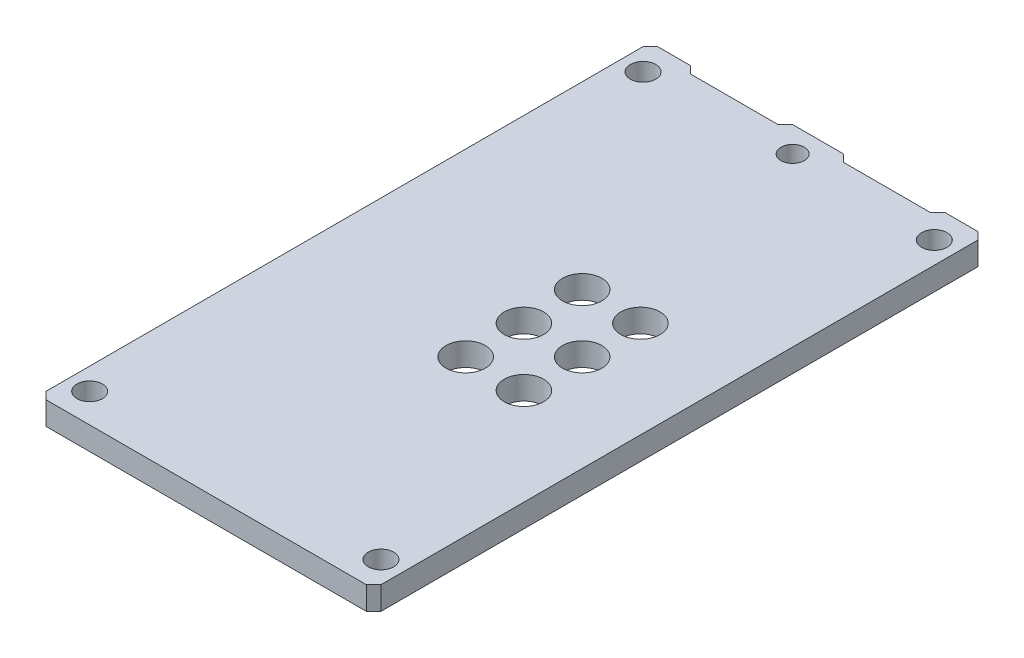
ISO-10303-21;
HEADER;
FILE_DESCRIPTION(('STEP AP214'),'2;1');
FILE_NAME('part.step','',(''),(''),'','','');
FILE_SCHEMA(('AUTOMOTIVE_DESIGN { 1 0 10303 214 1 1 1 1 }'));
ENDSEC;
DATA;
#1=APPLICATION_CONTEXT('core data for automotive mechanical design processes');
#2=APPLICATION_PROTOCOL_DEFINITION('international standard','automotive_design',2000,#1);
#3=PRODUCT_CONTEXT('',#1,'mechanical');
#4=PRODUCT('Part','Part','',(#3));
#5=PRODUCT_RELATED_PRODUCT_CATEGORY('part','',(#4));
#6=PRODUCT_DEFINITION_FORMATION('','',#4);
#7=PRODUCT_DEFINITION_CONTEXT('part definition',#1,'design');
#8=PRODUCT_DEFINITION('design','',#6,#7);
#9=PRODUCT_DEFINITION_SHAPE('','',#8);
#10=(LENGTH_UNIT() NAMED_UNIT(*) SI_UNIT(.MILLI.,.METRE.));
#11=(NAMED_UNIT(*) PLANE_ANGLE_UNIT() SI_UNIT($,.RADIAN.));
#12=(NAMED_UNIT(*) SI_UNIT($,.STERADIAN.) SOLID_ANGLE_UNIT());
#13=UNCERTAINTY_MEASURE_WITH_UNIT(LENGTH_MEASURE(1.E-05),#10,'distance_accuracy_value','');
#14=(GEOMETRIC_REPRESENTATION_CONTEXT(3) GLOBAL_UNCERTAINTY_ASSIGNED_CONTEXT((#13)) GLOBAL_UNIT_ASSIGNED_CONTEXT((#10,
#11,#12)) REPRESENTATION_CONTEXT('',''));
#15=CARTESIAN_POINT('',(0.,0.,0.));
#16=DIRECTION('',(0.,0.,1.));
#17=DIRECTION('',(1.,0.,0.));
#18=AXIS2_PLACEMENT_3D('',#15,#16,#17);
#19=CARTESIAN_POINT('',(23.,1.5875,0.));
#20=DIRECTION('',(0.,1.,0.));
#21=DIRECTION('',(0.,0.,1.));
#22=AXIS2_PLACEMENT_3D('',#19,#20,#21);
#23=PLANE('',#22);
#24=CARTESIAN_POINT('',(1.5,1.5875,-40.));
#25=DIRECTION('',(0.,1.,0.));
#26=DIRECTION('',(0.,0.,1.));
#27=AXIS2_PLACEMENT_3D('',#24,#25,#26);
#28=CIRCLE('',#27,0.875000000000001);
#29=CARTESIAN_POINT('',(1.5,1.5875,-39.125));
#30=VERTEX_POINT('',#29);
#31=EDGE_CURVE('E370',#30,#30,#28,.T.);
#32=ORIENTED_EDGE('',*,*,#31,.F.);
#33=EDGE_LOOP('',(#32));
#34=FACE_BOUND('',#33,.T.);
#35=CARTESIAN_POINT('',(21.5,1.5875,-2.));
#36=DIRECTION('',(0.,1.,0.));
#37=DIRECTION('',(0.,0.,1.));
#38=AXIS2_PLACEMENT_3D('',#35,#36,#37);
#39=CIRCLE('',#38,0.875000000000002);
#40=CARTESIAN_POINT('',(21.5,1.5875,-1.125));
#41=VERTEX_POINT('',#40);
#42=EDGE_CURVE('E382',#41,#41,#39,.T.);
#43=ORIENTED_EDGE('',*,*,#42,.F.);
#44=EDGE_LOOP('',(#43));
#45=FACE_BOUND('',#44,.T.);
#46=CARTESIAN_POINT('',(16.36,1.5875,-24.96));
#47=DIRECTION('',(0.,1.,0.));
#48=DIRECTION('',(0.,0.,1.));
#49=AXIS2_PLACEMENT_3D('',#46,#47,#48);
#50=CIRCLE('',#49,1.35);
#51=CARTESIAN_POINT('',(16.36,1.5875,-23.61));
#52=VERTEX_POINT('',#51);
#53=EDGE_CURVE('E394',#52,#52,#50,.T.);
#54=ORIENTED_EDGE('',*,*,#53,.F.);
#55=EDGE_LOOP('',(#54));
#56=FACE_BOUND('',#55,.T.);
#57=CARTESIAN_POINT('',(16.36,1.5875,-20.96));
#58=DIRECTION('',(0.,1.,0.));
#59=DIRECTION('',(0.,0.,1.));
#60=AXIS2_PLACEMENT_3D('',#57,#58,#59);
#61=CIRCLE('',#60,1.35);
#62=CARTESIAN_POINT('',(16.36,1.5875,-19.61));
#63=VERTEX_POINT('',#62);
#64=EDGE_CURVE('E406',#63,#63,#61,.T.);
#65=ORIENTED_EDGE('',*,*,#64,.F.);
#66=EDGE_LOOP('',(#65));
#67=FACE_BOUND('',#66,.T.);
#68=CARTESIAN_POINT('',(16.36,1.5875,-16.96));
#69=DIRECTION('',(0.,1.,0.));
#70=DIRECTION('',(0.,0.,1.));
#71=AXIS2_PLACEMENT_3D('',#68,#69,#70);
#72=CIRCLE('',#71,1.35);
#73=CARTESIAN_POINT('',(16.36,1.5875,-15.61));
#74=VERTEX_POINT('',#73);
#75=EDGE_CURVE('E418',#74,#74,#72,.T.);
#76=ORIENTED_EDGE('',*,*,#75,.F.);
#77=EDGE_LOOP('',(#76));
#78=FACE_BOUND('',#77,.T.);
#79=DIRECTION('',(1.,0.,0.));
#80=VECTOR('',#79,1.);
#81=CARTESIAN_POINT('',(0.500000000000004,1.5875,0.));
#82=LINE('',#81,#80);
#83=CARTESIAN_POINT('',(0.500000000000004,1.5875,0.));
#84=VERTEX_POINT('',#83);
#85=CARTESIAN_POINT('',(22.5,1.5875,0.));
#86=VERTEX_POINT('',#85);
#87=EDGE_CURVE('E207',#84,#86,#82,.T.);
#88=ORIENTED_EDGE('',*,*,#87,.T.);
#89=DIRECTION('',(0.707106781186547,0.,-0.707106781186547));
#90=VECTOR('',#89,1.);
#91=CARTESIAN_POINT('',(22.5,1.5875,0.));
#92=LINE('',#91,#90);
#93=CARTESIAN_POINT('',(23.,1.5875,-0.5));
#94=VERTEX_POINT('',#93);
#95=EDGE_CURVE('E115',#86,#94,#92,.T.);
#96=ORIENTED_EDGE('',*,*,#95,.T.);
#97=DIRECTION('',(0.,0.,-1.));
#98=VECTOR('',#97,1.);
#99=CARTESIAN_POINT('',(23.,1.5875,-0.5));
#100=LINE('',#99,#98);
#101=CARTESIAN_POINT('',(23.,1.5875,-41.5));
#102=VERTEX_POINT('',#101);
#103=EDGE_CURVE('E246',#94,#102,#100,.T.);
#104=ORIENTED_EDGE('',*,*,#103,.T.);
#105=DIRECTION('',(-0.707106781186547,0.,-0.707106781186547));
#106=VECTOR('',#105,1.);
#107=CARTESIAN_POINT('',(23.,1.5875,-41.5));
#108=LINE('',#107,#106);
#109=CARTESIAN_POINT('',(22.5,1.5875,-42.));
#110=VERTEX_POINT('',#109);
#111=EDGE_CURVE('E265',#102,#110,#108,.T.);
#112=ORIENTED_EDGE('',*,*,#111,.T.);
#113=DIRECTION('',(-1.,0.,0.));
#114=VECTOR('',#113,1.);
#115=CARTESIAN_POINT('',(20.25,1.5875,-42.));
#116=LINE('',#115,#114);
#117=CARTESIAN_POINT('',(20.25,1.5875,-42.));
#118=VERTEX_POINT('',#117);
#119=EDGE_CURVE('E262',#110,#118,#116,.T.);
#120=ORIENTED_EDGE('',*,*,#119,.T.);
#121=DIRECTION('',(-0.707106781186545,0.,0.70710678118655));
#122=VECTOR('',#121,1.);
#123=CARTESIAN_POINT('',(19.75,1.5875,-41.5));
#124=LINE('',#123,#122);
#125=CARTESIAN_POINT('',(19.75,1.5875,-41.5));
#126=VERTEX_POINT('',#125);
#127=EDGE_CURVE('E264',#118,#126,#124,.T.);
#128=ORIENTED_EDGE('',*,*,#127,.T.);
#129=DIRECTION('',(-1.,0.,0.));
#130=VECTOR('',#129,1.);
#131=CARTESIAN_POINT('',(13.75,1.5875,-41.5));
#132=LINE('',#131,#130);
#133=CARTESIAN_POINT('',(13.75,1.5875,-41.5));
#134=VERTEX_POINT('',#133);
#135=EDGE_CURVE('E267',#126,#134,#132,.T.);
#136=ORIENTED_EDGE('',*,*,#135,.T.);
#137=DIRECTION('',(-0.707106781186547,0.,-0.707106781186547));
#138=VECTOR('',#137,1.);
#139=CARTESIAN_POINT('',(13.25,1.5875,-42.));
#140=LINE('',#139,#138);
#141=CARTESIAN_POINT('',(13.25,1.5875,-42.));
#142=VERTEX_POINT('',#141);
#143=EDGE_CURVE('E273',#134,#142,#140,.T.);
#144=ORIENTED_EDGE('',*,*,#143,.T.);
#145=DIRECTION('',(-1.,0.,0.));
#146=VECTOR('',#145,1.);
#147=CARTESIAN_POINT('',(9.75,1.5875,-42.));
#148=LINE('',#147,#146);
#149=CARTESIAN_POINT('',(9.75,1.5875,-42.));
#150=VERTEX_POINT('',#149);
#151=EDGE_CURVE('E275',#142,#150,#148,.T.);
#152=ORIENTED_EDGE('',*,*,#151,.T.);
#153=DIRECTION('',(-0.707106781186547,0.,0.707106781186547));
#154=VECTOR('',#153,1.);
#155=CARTESIAN_POINT('',(9.75,1.5875,-42.));
#156=LINE('',#155,#154);
#157=CARTESIAN_POINT('',(9.25,1.5875,-41.5));
#158=VERTEX_POINT('',#157);
#159=EDGE_CURVE('E277',#150,#158,#156,.T.);
#160=ORIENTED_EDGE('',*,*,#159,.T.);
#161=DIRECTION('',(-1.,0.,0.));
#162=VECTOR('',#161,1.);
#163=CARTESIAN_POINT('',(9.25,1.5875,-41.5));
#164=LINE('',#163,#162);
#165=CARTESIAN_POINT('',(3.25,1.5875,-41.5));
#166=VERTEX_POINT('',#165);
#167=EDGE_CURVE('E279',#158,#166,#164,.T.);
#168=ORIENTED_EDGE('',*,*,#167,.T.);
#169=DIRECTION('',(-0.707106781186547,0.,-0.707106781186548));
#170=VECTOR('',#169,1.);
#171=CARTESIAN_POINT('',(3.25,1.5875,-41.5));
#172=LINE('',#171,#170);
#173=CARTESIAN_POINT('',(2.75,1.5875,-42.));
#174=VERTEX_POINT('',#173);
#175=EDGE_CURVE('E281',#166,#174,#172,.T.);
#176=ORIENTED_EDGE('',*,*,#175,.T.);
#177=DIRECTION('',(-1.,0.,0.));
#178=VECTOR('',#177,1.);
#179=CARTESIAN_POINT('',(2.75,1.5875,-42.));
#180=LINE('',#179,#178);
#181=CARTESIAN_POINT('',(0.500000000000001,1.5875,-42.));
#182=VERTEX_POINT('',#181);
#183=EDGE_CURVE('E158',#174,#182,#180,.T.);
#184=ORIENTED_EDGE('',*,*,#183,.T.);
#185=DIRECTION('',(-0.707106781186548,0.,0.707106781186547));
#186=VECTOR('',#185,1.);
#187=CARTESIAN_POINT('',(0.500000000000001,1.5875,-42.));
#188=LINE('',#187,#186);
#189=CARTESIAN_POINT('',(0.,1.5875,-41.5));
#190=VERTEX_POINT('',#189);
#191=EDGE_CURVE('E152',#182,#190,#188,.T.);
#192=ORIENTED_EDGE('',*,*,#191,.T.);
#193=DIRECTION('',(0.,0.,1.));
#194=VECTOR('',#193,1.);
#195=CARTESIAN_POINT('',(0.,1.5875,-41.5));
#196=LINE('',#195,#194);
#197=CARTESIAN_POINT('',(0.,1.5875,-0.5));
#198=VERTEX_POINT('',#197);
#199=EDGE_CURVE('E156',#190,#198,#196,.T.);
#200=ORIENTED_EDGE('',*,*,#199,.T.);
#201=DIRECTION('',(0.707106781186547,0.,0.707106781186548));
#202=VECTOR('',#201,1.);
#203=CARTESIAN_POINT('',(0.,1.5875,-0.5));
#204=LINE('',#203,#202);
#205=EDGE_CURVE('E48',#198,#84,#204,.T.);
#206=ORIENTED_EDGE('',*,*,#205,.T.);
#207=EDGE_LOOP('',(#88,#96,#104,#112,#120,#128,#136,#144,#152,#160,#168,#176,#184,#192,#200,#206));
#208=FACE_BOUND('',#207,.T.);
#209=CARTESIAN_POINT('',(12.36,1.5875,-16.96));
#210=DIRECTION('',(0.,1.,0.));
#211=DIRECTION('',(0.,0.,1.));
#212=AXIS2_PLACEMENT_3D('',#209,#210,#211);
#213=CIRCLE('',#212,1.35);
#214=CARTESIAN_POINT('',(12.36,1.5875,-15.61));
#215=VERTEX_POINT('',#214);
#216=EDGE_CURVE('E180',#215,#215,#213,.T.);
#217=ORIENTED_EDGE('',*,*,#216,.F.);
#218=EDGE_LOOP('',(#217));
#219=FACE_BOUND('',#218,.T.);
#220=CARTESIAN_POINT('',(12.36,1.5875,-20.96));
#221=DIRECTION('',(0.,1.,0.));
#222=DIRECTION('',(0.,0.,1.));
#223=AXIS2_PLACEMENT_3D('',#220,#221,#222);
#224=CIRCLE('',#223,1.35);
#225=CARTESIAN_POINT('',(12.36,1.5875,-19.61));
#226=VERTEX_POINT('',#225);
#227=EDGE_CURVE('E412',#226,#226,#224,.T.);
#228=ORIENTED_EDGE('',*,*,#227,.F.);
#229=EDGE_LOOP('',(#228));
#230=FACE_BOUND('',#229,.T.);
#231=CARTESIAN_POINT('',(12.36,1.5875,-24.96));
#232=DIRECTION('',(0.,1.,0.));
#233=DIRECTION('',(0.,0.,1.));
#234=AXIS2_PLACEMENT_3D('',#231,#232,#233);
#235=CIRCLE('',#234,1.35);
#236=CARTESIAN_POINT('',(12.36,1.5875,-23.61));
#237=VERTEX_POINT('',#236);
#238=EDGE_CURVE('E400',#237,#237,#235,.T.);
#239=ORIENTED_EDGE('',*,*,#238,.F.);
#240=EDGE_LOOP('',(#239));
#241=FACE_BOUND('',#240,.T.);
#242=CARTESIAN_POINT('',(21.5,1.5875,-40.));
#243=DIRECTION('',(0.,1.,0.));
#244=DIRECTION('',(0.,0.,1.));
#245=AXIS2_PLACEMENT_3D('',#242,#243,#244);
#246=CIRCLE('',#245,0.875000000000002);
#247=CARTESIAN_POINT('',(21.5,1.5875,-39.125));
#248=VERTEX_POINT('',#247);
#249=EDGE_CURVE('E388',#248,#248,#246,.T.);
#250=ORIENTED_EDGE('',*,*,#249,.F.);
#251=EDGE_LOOP('',(#250));
#252=FACE_BOUND('',#251,.T.);
#253=CARTESIAN_POINT('',(1.5,1.5875,-2.));
#254=DIRECTION('',(0.,1.,0.));
#255=DIRECTION('',(0.,0.,1.));
#256=AXIS2_PLACEMENT_3D('',#253,#254,#255);
#257=CIRCLE('',#256,0.875);
#258=CARTESIAN_POINT('',(1.5,1.5875,-1.125));
#259=VERTEX_POINT('',#258);
#260=EDGE_CURVE('E376',#259,#259,#257,.T.);
#261=ORIENTED_EDGE('',*,*,#260,.F.);
#262=EDGE_LOOP('',(#261));
#263=FACE_BOUND('',#262,.T.);
#264=CARTESIAN_POINT('',(11.5154,1.5875,-40.2552));
#265=DIRECTION('',(0.,1.,0.));
#266=DIRECTION('',(0.,0.,1.));
#267=AXIS2_PLACEMENT_3D('',#264,#265,#266);
#268=CIRCLE('',#267,0.8001);
#269=CARTESIAN_POINT('',(11.5154,1.5875,-39.4551));
#270=VERTEX_POINT('',#269);
#271=EDGE_CURVE('E361',#270,#270,#268,.T.);
#272=ORIENTED_EDGE('',*,*,#271,.F.);
#273=EDGE_LOOP('',(#272));
#274=FACE_BOUND('',#273,.T.);
#275=ADVANCED_FACE('F31',(#34,#45,#56,#67,#78,#208,#219,#230,#241,#252,#263,#274),#23,.T.);
#276=CARTESIAN_POINT('',(23.,0.,0.));
#277=DIRECTION('',(0.,1.,0.));
#278=DIRECTION('',(0.,0.,1.));
#279=AXIS2_PLACEMENT_3D('',#276,#277,#278);
#280=PLANE('',#279);
#281=CARTESIAN_POINT('',(1.5,0.,-40.));
#282=DIRECTION('',(0.,1.,0.));
#283=DIRECTION('',(0.,0.,1.));
#284=AXIS2_PLACEMENT_3D('',#281,#282,#283);
#285=CIRCLE('',#284,0.875000000000001);
#286=CARTESIAN_POINT('',(1.5,0.,-39.125));
#287=VERTEX_POINT('',#286);
#288=EDGE_CURVE('E367',#287,#287,#285,.T.);
#289=ORIENTED_EDGE('',*,*,#288,.T.);
#290=EDGE_LOOP('',(#289));
#291=FACE_BOUND('',#290,.T.);
#292=CARTESIAN_POINT('',(21.5,0.,-2.));
#293=DIRECTION('',(0.,1.,0.));
#294=DIRECTION('',(0.,0.,1.));
#295=AXIS2_PLACEMENT_3D('',#292,#293,#294);
#296=CIRCLE('',#295,0.875000000000002);
#297=CARTESIAN_POINT('',(21.5,0.,-1.125));
#298=VERTEX_POINT('',#297);
#299=EDGE_CURVE('E379',#298,#298,#296,.T.);
#300=ORIENTED_EDGE('',*,*,#299,.T.);
#301=EDGE_LOOP('',(#300));
#302=FACE_BOUND('',#301,.T.);
#303=CARTESIAN_POINT('',(16.36,0.,-24.96));
#304=DIRECTION('',(0.,1.,0.));
#305=DIRECTION('',(0.,0.,1.));
#306=AXIS2_PLACEMENT_3D('',#303,#304,#305);
#307=CIRCLE('',#306,1.35);
#308=CARTESIAN_POINT('',(16.36,0.,-23.61));
#309=VERTEX_POINT('',#308);
#310=EDGE_CURVE('E391',#309,#309,#307,.T.);
#311=ORIENTED_EDGE('',*,*,#310,.T.);
#312=EDGE_LOOP('',(#311));
#313=FACE_BOUND('',#312,.T.);
#314=CARTESIAN_POINT('',(16.36,0.,-20.96));
#315=DIRECTION('',(0.,1.,0.));
#316=DIRECTION('',(0.,0.,1.));
#317=AXIS2_PLACEMENT_3D('',#314,#315,#316);
#318=CIRCLE('',#317,1.35);
#319=CARTESIAN_POINT('',(16.36,0.,-19.61));
#320=VERTEX_POINT('',#319);
#321=EDGE_CURVE('E403',#320,#320,#318,.T.);
#322=ORIENTED_EDGE('',*,*,#321,.T.);
#323=EDGE_LOOP('',(#322));
#324=FACE_BOUND('',#323,.T.);
#325=CARTESIAN_POINT('',(16.36,0.,-16.96));
#326=DIRECTION('',(0.,1.,0.));
#327=DIRECTION('',(0.,0.,1.));
#328=AXIS2_PLACEMENT_3D('',#325,#326,#327);
#329=CIRCLE('',#328,1.35);
#330=CARTESIAN_POINT('',(16.36,0.,-15.61));
#331=VERTEX_POINT('',#330);
#332=EDGE_CURVE('E415',#331,#331,#329,.T.);
#333=ORIENTED_EDGE('',*,*,#332,.T.);
#334=EDGE_LOOP('',(#333));
#335=FACE_BOUND('',#334,.T.);
#336=DIRECTION('',(1.,0.,0.));
#337=VECTOR('',#336,1.);
#338=CARTESIAN_POINT('',(0.500000000000004,0.,0.));
#339=LINE('',#338,#337);
#340=CARTESIAN_POINT('',(0.500000000000004,0.,0.));
#341=VERTEX_POINT('',#340);
#342=CARTESIAN_POINT('',(22.5,0.,0.));
#343=VERTEX_POINT('',#342);
#344=EDGE_CURVE('E176',#341,#343,#339,.T.);
#345=ORIENTED_EDGE('',*,*,#344,.F.);
#346=DIRECTION('',(0.707106781186547,0.,0.707106781186548));
#347=VECTOR('',#346,1.);
#348=CARTESIAN_POINT('',(0.,0.,-0.5));
#349=LINE('',#348,#347);
#350=CARTESIAN_POINT('',(0.,0.,-0.5));
#351=VERTEX_POINT('',#350);
#352=EDGE_CURVE('E107',#351,#341,#349,.T.);
#353=ORIENTED_EDGE('',*,*,#352,.F.);
#354=DIRECTION('',(0.,0.,1.));
#355=VECTOR('',#354,1.);
#356=CARTESIAN_POINT('',(0.,0.,-41.5));
#357=LINE('',#356,#355);
#358=CARTESIAN_POINT('',(0.,0.,-41.5));
#359=VERTEX_POINT('',#358);
#360=EDGE_CURVE('E101',#359,#351,#357,.T.);
#361=ORIENTED_EDGE('',*,*,#360,.F.);
#362=DIRECTION('',(-0.707106781186548,0.,0.707106781186547));
#363=VECTOR('',#362,1.);
#364=CARTESIAN_POINT('',(0.500000000000001,0.,-42.));
#365=LINE('',#364,#363);
#366=CARTESIAN_POINT('',(0.500000000000001,0.,-42.));
#367=VERTEX_POINT('',#366);
#368=EDGE_CURVE('E166',#367,#359,#365,.T.);
#369=ORIENTED_EDGE('',*,*,#368,.F.);
#370=DIRECTION('',(-1.,0.,0.));
#371=VECTOR('',#370,1.);
#372=CARTESIAN_POINT('',(2.75,0.,-42.));
#373=LINE('',#372,#371);
#374=CARTESIAN_POINT('',(2.75,0.,-42.));
#375=VERTEX_POINT('',#374);
#376=EDGE_CURVE('E202',#375,#367,#373,.T.);
#377=ORIENTED_EDGE('',*,*,#376,.F.);
#378=DIRECTION('',(-0.707106781186547,0.,-0.707106781186548));
#379=VECTOR('',#378,1.);
#380=CARTESIAN_POINT('',(3.25,0.,-41.5));
#381=LINE('',#380,#379);
#382=CARTESIAN_POINT('',(3.25,0.,-41.5));
#383=VERTEX_POINT('',#382);
#384=EDGE_CURVE('E200',#383,#375,#381,.T.);
#385=ORIENTED_EDGE('',*,*,#384,.F.);
#386=DIRECTION('',(-1.,0.,0.));
#387=VECTOR('',#386,1.);
#388=CARTESIAN_POINT('',(9.25,0.,-41.5));
#389=LINE('',#388,#387);
#390=CARTESIAN_POINT('',(9.25,0.,-41.5));
#391=VERTEX_POINT('',#390);
#392=EDGE_CURVE('E198',#391,#383,#389,.T.);
#393=ORIENTED_EDGE('',*,*,#392,.F.);
#394=DIRECTION('',(-0.707106781186547,0.,0.707106781186547));
#395=VECTOR('',#394,1.);
#396=CARTESIAN_POINT('',(9.75,0.,-42.));
#397=LINE('',#396,#395);
#398=CARTESIAN_POINT('',(9.75,0.,-42.));
#399=VERTEX_POINT('',#398);
#400=EDGE_CURVE('E196',#399,#391,#397,.T.);
#401=ORIENTED_EDGE('',*,*,#400,.F.);
#402=DIRECTION('',(-1.,0.,0.));
#403=VECTOR('',#402,1.);
#404=CARTESIAN_POINT('',(9.75,0.,-42.));
#405=LINE('',#404,#403);
#406=CARTESIAN_POINT('',(13.25,0.,-42.));
#407=VERTEX_POINT('',#406);
#408=EDGE_CURVE('E194',#407,#399,#405,.T.);
#409=ORIENTED_EDGE('',*,*,#408,.F.);
#410=DIRECTION('',(-0.707106781186547,0.,-0.707106781186547));
#411=VECTOR('',#410,1.);
#412=CARTESIAN_POINT('',(13.25,0.,-42.));
#413=LINE('',#412,#411);
#414=CARTESIAN_POINT('',(13.75,0.,-41.5));
#415=VERTEX_POINT('',#414);
#416=EDGE_CURVE('E192',#415,#407,#413,.T.);
#417=ORIENTED_EDGE('',*,*,#416,.F.);
#418=DIRECTION('',(-1.,0.,0.));
#419=VECTOR('',#418,1.);
#420=CARTESIAN_POINT('',(13.75,0.,-41.5));
#421=LINE('',#420,#419);
#422=CARTESIAN_POINT('',(19.75,0.,-41.5));
#423=VERTEX_POINT('',#422);
#424=EDGE_CURVE('E190',#423,#415,#421,.T.);
#425=ORIENTED_EDGE('',*,*,#424,.F.);
#426=DIRECTION('',(-0.707106781186545,0.,0.70710678118655));
#427=VECTOR('',#426,1.);
#428=CARTESIAN_POINT('',(19.75,0.,-41.5));
#429=LINE('',#428,#427);
#430=CARTESIAN_POINT('',(20.25,0.,-42.));
#431=VERTEX_POINT('',#430);
#432=EDGE_CURVE('E188',#431,#423,#429,.T.);
#433=ORIENTED_EDGE('',*,*,#432,.F.);
#434=DIRECTION('',(-1.,0.,0.));
#435=VECTOR('',#434,1.);
#436=CARTESIAN_POINT('',(20.25,0.,-42.));
#437=LINE('',#436,#435);
#438=CARTESIAN_POINT('',(22.5,0.,-42.));
#439=VERTEX_POINT('',#438);
#440=EDGE_CURVE('E186',#439,#431,#437,.T.);
#441=ORIENTED_EDGE('',*,*,#440,.F.);
#442=DIRECTION('',(-0.707106781186547,0.,-0.707106781186547));
#443=VECTOR('',#442,1.);
#444=CARTESIAN_POINT('',(23.,0.,-41.5));
#445=LINE('',#444,#443);
#446=CARTESIAN_POINT('',(23.,0.,-41.5));
#447=VERTEX_POINT('',#446);
#448=EDGE_CURVE('E184',#447,#439,#445,.T.);
#449=ORIENTED_EDGE('',*,*,#448,.F.);
#450=DIRECTION('',(0.,0.,-1.));
#451=VECTOR('',#450,1.);
#452=CARTESIAN_POINT('',(23.,0.,-0.5));
#453=LINE('',#452,#451);
#454=CARTESIAN_POINT('',(23.,0.,-0.5));
#455=VERTEX_POINT('',#454);
#456=EDGE_CURVE('E182',#455,#447,#453,.T.);
#457=ORIENTED_EDGE('',*,*,#456,.F.);
#458=DIRECTION('',(0.707106781186547,0.,-0.707106781186547));
#459=VECTOR('',#458,1.);
#460=CARTESIAN_POINT('',(22.5,0.,0.));
#461=LINE('',#460,#459);
#462=EDGE_CURVE('E179',#343,#455,#461,.T.);
#463=ORIENTED_EDGE('',*,*,#462,.F.);
#464=EDGE_LOOP('',(#345,#353,#361,#369,#377,#385,#393,#401,#409,#417,#425,#433,#441,#449,#457,#463));
#465=FACE_BOUND('',#464,.T.);
#466=CARTESIAN_POINT('',(12.36,0.,-16.96));
#467=DIRECTION('',(0.,1.,0.));
#468=DIRECTION('',(0.,0.,1.));
#469=AXIS2_PLACEMENT_3D('',#466,#467,#468);
#470=CIRCLE('',#469,1.35);
#471=CARTESIAN_POINT('',(12.36,0.,-15.61));
#472=VERTEX_POINT('',#471);
#473=EDGE_CURVE('E421',#472,#472,#470,.T.);
#474=ORIENTED_EDGE('',*,*,#473,.T.);
#475=EDGE_LOOP('',(#474));
#476=FACE_BOUND('',#475,.T.);
#477=CARTESIAN_POINT('',(12.36,0.,-20.96));
#478=DIRECTION('',(0.,1.,0.));
#479=DIRECTION('',(0.,0.,1.));
#480=AXIS2_PLACEMENT_3D('',#477,#478,#479);
#481=CIRCLE('',#480,1.35);
#482=CARTESIAN_POINT('',(12.36,0.,-19.61));
#483=VERTEX_POINT('',#482);
#484=EDGE_CURVE('E409',#483,#483,#481,.T.);
#485=ORIENTED_EDGE('',*,*,#484,.T.);
#486=EDGE_LOOP('',(#485));
#487=FACE_BOUND('',#486,.T.);
#488=CARTESIAN_POINT('',(12.36,0.,-24.96));
#489=DIRECTION('',(0.,1.,0.));
#490=DIRECTION('',(0.,0.,1.));
#491=AXIS2_PLACEMENT_3D('',#488,#489,#490);
#492=CIRCLE('',#491,1.35);
#493=CARTESIAN_POINT('',(12.36,0.,-23.61));
#494=VERTEX_POINT('',#493);
#495=EDGE_CURVE('E397',#494,#494,#492,.T.);
#496=ORIENTED_EDGE('',*,*,#495,.T.);
#497=EDGE_LOOP('',(#496));
#498=FACE_BOUND('',#497,.T.);
#499=CARTESIAN_POINT('',(21.5,0.,-40.));
#500=DIRECTION('',(0.,1.,0.));
#501=DIRECTION('',(0.,0.,1.));
#502=AXIS2_PLACEMENT_3D('',#499,#500,#501);
#503=CIRCLE('',#502,0.875000000000002);
#504=CARTESIAN_POINT('',(21.5,0.,-39.125));
#505=VERTEX_POINT('',#504);
#506=EDGE_CURVE('E385',#505,#505,#503,.T.);
#507=ORIENTED_EDGE('',*,*,#506,.T.);
#508=EDGE_LOOP('',(#507));
#509=FACE_BOUND('',#508,.T.);
#510=CARTESIAN_POINT('',(1.5,0.,-2.));
#511=DIRECTION('',(0.,1.,0.));
#512=DIRECTION('',(0.,0.,1.));
#513=AXIS2_PLACEMENT_3D('',#510,#511,#512);
#514=CIRCLE('',#513,0.875);
#515=CARTESIAN_POINT('',(1.5,0.,-1.125));
#516=VERTEX_POINT('',#515);
#517=EDGE_CURVE('E373',#516,#516,#514,.T.);
#518=ORIENTED_EDGE('',*,*,#517,.T.);
#519=EDGE_LOOP('',(#518));
#520=FACE_BOUND('',#519,.T.);
#521=CARTESIAN_POINT('',(11.5154,0.,-40.2552));
#522=DIRECTION('',(0.,1.,0.));
#523=DIRECTION('',(0.,0.,1.));
#524=AXIS2_PLACEMENT_3D('',#521,#522,#523);
#525=CIRCLE('',#524,0.8001);
#526=CARTESIAN_POINT('',(11.5154,0.,-39.4551));
#527=VERTEX_POINT('',#526);
#528=EDGE_CURVE('E364',#527,#527,#525,.T.);
#529=ORIENTED_EDGE('',*,*,#528,.T.);
#530=EDGE_LOOP('',(#529));
#531=FACE_BOUND('',#530,.T.);
#532=ADVANCED_FACE('F250',(#291,#302,#313,#324,#335,#465,#476,#487,#498,#509,#520,#531),#280,.F.);
#533=CARTESIAN_POINT('',(0.500000000000004,1.5875,0.));
#534=DIRECTION('',(0.,0.,-1.));
#535=DIRECTION('',(-1.,0.,0.));
#536=AXIS2_PLACEMENT_3D('',#533,#534,#535);
#537=PLANE('',#536);
#538=ORIENTED_EDGE('',*,*,#344,.T.);
#539=DIRECTION('',(0.,-1.,0.));
#540=VECTOR('',#539,1.);
#541=CARTESIAN_POINT('',(22.5,1.5875,0.));
#542=LINE('',#541,#540);
#543=EDGE_CURVE('E11',#86,#343,#542,.T.);
#544=ORIENTED_EDGE('',*,*,#543,.F.);
#545=ORIENTED_EDGE('',*,*,#87,.F.);
#546=DIRECTION('',(0.,-1.,0.));
#547=VECTOR('',#546,1.);
#548=CARTESIAN_POINT('',(0.500000000000004,1.5875,0.));
#549=LINE('',#548,#547);
#550=EDGE_CURVE('E172',#84,#341,#549,.T.);
#551=ORIENTED_EDGE('',*,*,#550,.T.);
#552=EDGE_LOOP('',(#538,#544,#545,#551));
#553=FACE_BOUND('',#552,.T.);
#554=ADVANCED_FACE('F33',(#553),#537,.F.);
#555=CARTESIAN_POINT('',(22.5,1.5875,0.));
#556=DIRECTION('',(-0.707106781186548,0.,-0.707106781186548));
#557=DIRECTION('',(-0.707106781186548,0.,0.707106781186548));
#558=AXIS2_PLACEMENT_3D('',#555,#556,#557);
#559=PLANE('',#558);
#560=ORIENTED_EDGE('',*,*,#462,.T.);
#561=DIRECTION('',(0.,-1.,0.));
#562=VECTOR('',#561,1.);
#563=CARTESIAN_POINT('',(23.,1.5875,-0.5));
#564=LINE('',#563,#562);
#565=EDGE_CURVE('E40',#94,#455,#564,.T.);
#566=ORIENTED_EDGE('',*,*,#565,.F.);
#567=ORIENTED_EDGE('',*,*,#95,.F.);
#568=ORIENTED_EDGE('',*,*,#543,.T.);
#569=EDGE_LOOP('',(#560,#566,#567,#568));
#570=FACE_BOUND('',#569,.T.);
#571=ADVANCED_FACE('F633',(#570),#559,.F.);
#572=CARTESIAN_POINT('',(23.,1.5875,-0.5));
#573=DIRECTION('',(-1.,0.,0.));
#574=DIRECTION('',(0.,0.,1.));
#575=AXIS2_PLACEMENT_3D('',#572,#573,#574);
#576=PLANE('',#575);
#577=ORIENTED_EDGE('',*,*,#456,.T.);
#578=DIRECTION('',(0.,-1.,0.));
#579=VECTOR('',#578,1.);
#580=CARTESIAN_POINT('',(23.,1.5875,-41.5));
#581=LINE('',#580,#579);
#582=EDGE_CURVE('E238',#102,#447,#581,.T.);
#583=ORIENTED_EDGE('',*,*,#582,.F.);
#584=ORIENTED_EDGE('',*,*,#103,.F.);
#585=ORIENTED_EDGE('',*,*,#565,.T.);
#586=EDGE_LOOP('',(#577,#583,#584,#585));
#587=FACE_BOUND('',#586,.T.);
#588=ADVANCED_FACE('F244',(#587),#576,.F.);
#589=CARTESIAN_POINT('',(23.,1.5875,-41.5));
#590=DIRECTION('',(-0.707106781186548,0.,0.707106781186548));
#591=DIRECTION('',(0.707106781186548,0.,0.707106781186548));
#592=AXIS2_PLACEMENT_3D('',#589,#590,#591);
#593=PLANE('',#592);
#594=ORIENTED_EDGE('',*,*,#448,.T.);
#595=DIRECTION('',(0.,-1.,0.));
#596=VECTOR('',#595,1.);
#597=CARTESIAN_POINT('',(22.5,1.5875,-42.));
#598=LINE('',#597,#596);
#599=EDGE_CURVE('E235',#110,#439,#598,.T.);
#600=ORIENTED_EDGE('',*,*,#599,.F.);
#601=ORIENTED_EDGE('',*,*,#111,.F.);
#602=ORIENTED_EDGE('',*,*,#582,.T.);
#603=EDGE_LOOP('',(#594,#600,#601,#602));
#604=FACE_BOUND('',#603,.T.);
#605=ADVANCED_FACE('F256',(#604),#593,.F.);
#606=CARTESIAN_POINT('',(20.25,1.5875,-42.));
#607=DIRECTION('',(0.,0.,1.));
#608=DIRECTION('',(1.,0.,0.));
#609=AXIS2_PLACEMENT_3D('',#606,#607,#608);
#610=PLANE('',#609);
#611=ORIENTED_EDGE('',*,*,#440,.T.);
#612=DIRECTION('',(0.,-1.,0.));
#613=VECTOR('',#612,1.);
#614=CARTESIAN_POINT('',(20.25,1.5875,-42.));
#615=LINE('',#614,#613);
#616=EDGE_CURVE('E232',#118,#431,#615,.T.);
#617=ORIENTED_EDGE('',*,*,#616,.F.);
#618=ORIENTED_EDGE('',*,*,#119,.F.);
#619=ORIENTED_EDGE('',*,*,#599,.T.);
#620=EDGE_LOOP('',(#611,#617,#618,#619));
#621=FACE_BOUND('',#620,.T.);
#622=ADVANCED_FACE('F260',(#621),#610,.F.);
#623=CARTESIAN_POINT('',(19.75,1.5875,-41.5));
#624=DIRECTION('',(0.70710678118655,0.,0.707106781186545));
#625=DIRECTION('',(0.707106781186545,0.,-0.70710678118655));
#626=AXIS2_PLACEMENT_3D('',#623,#624,#625);
#627=PLANE('',#626);
#628=ORIENTED_EDGE('',*,*,#432,.T.);
#629=DIRECTION('',(0.,-1.,0.));
#630=VECTOR('',#629,1.);
#631=CARTESIAN_POINT('',(19.75,1.5875,-41.5));
#632=LINE('',#631,#630);
#633=EDGE_CURVE('E229',#126,#423,#632,.T.);
#634=ORIENTED_EDGE('',*,*,#633,.F.);
#635=ORIENTED_EDGE('',*,*,#127,.F.);
#636=ORIENTED_EDGE('',*,*,#616,.T.);
#637=EDGE_LOOP('',(#628,#634,#635,#636));
#638=FACE_BOUND('',#637,.T.);
#639=ADVANCED_FACE('F598',(#638),#627,.F.);
#640=CARTESIAN_POINT('',(13.75,1.5875,-41.5));
#641=DIRECTION('',(0.,0.,1.));
#642=DIRECTION('',(1.,0.,0.));
#643=AXIS2_PLACEMENT_3D('',#640,#641,#642);
#644=PLANE('',#643);
#645=ORIENTED_EDGE('',*,*,#424,.T.);
#646=DIRECTION('',(0.,-1.,0.));
#647=VECTOR('',#646,1.);
#648=CARTESIAN_POINT('',(13.75,1.5875,-41.5));
#649=LINE('',#648,#647);
#650=EDGE_CURVE('E226',#134,#415,#649,.T.);
#651=ORIENTED_EDGE('',*,*,#650,.F.);
#652=ORIENTED_EDGE('',*,*,#135,.F.);
#653=ORIENTED_EDGE('',*,*,#633,.T.);
#654=EDGE_LOOP('',(#645,#651,#652,#653));
#655=FACE_BOUND('',#654,.T.);
#656=ADVANCED_FACE('F588',(#655),#644,.F.);
#657=CARTESIAN_POINT('',(13.25,1.5875,-42.));
#658=DIRECTION('',(-0.707106781186548,0.,0.707106781186548));
#659=DIRECTION('',(0.707106781186548,0.,0.707106781186548));
#660=AXIS2_PLACEMENT_3D('',#657,#658,#659);
#661=PLANE('',#660);
#662=ORIENTED_EDGE('',*,*,#416,.T.);
#663=DIRECTION('',(0.,-1.,0.));
#664=VECTOR('',#663,1.);
#665=CARTESIAN_POINT('',(13.25,1.5875,-42.));
#666=LINE('',#665,#664);
#667=EDGE_CURVE('E223',#142,#407,#666,.T.);
#668=ORIENTED_EDGE('',*,*,#667,.F.);
#669=ORIENTED_EDGE('',*,*,#143,.F.);
#670=ORIENTED_EDGE('',*,*,#650,.T.);
#671=EDGE_LOOP('',(#662,#668,#669,#670));
#672=FACE_BOUND('',#671,.T.);
#673=ADVANCED_FACE('F578',(#672),#661,.F.);
#674=CARTESIAN_POINT('',(9.75,1.5875,-42.));
#675=DIRECTION('',(0.,0.,1.));
#676=DIRECTION('',(1.,0.,0.));
#677=AXIS2_PLACEMENT_3D('',#674,#675,#676);
#678=PLANE('',#677);
#679=ORIENTED_EDGE('',*,*,#408,.T.);
#680=DIRECTION('',(0.,-1.,0.));
#681=VECTOR('',#680,1.);
#682=CARTESIAN_POINT('',(9.75,1.5875,-42.));
#683=LINE('',#682,#681);
#684=EDGE_CURVE('E220',#150,#399,#683,.T.);
#685=ORIENTED_EDGE('',*,*,#684,.F.);
#686=ORIENTED_EDGE('',*,*,#151,.F.);
#687=ORIENTED_EDGE('',*,*,#667,.T.);
#688=EDGE_LOOP('',(#679,#685,#686,#687));
#689=FACE_BOUND('',#688,.T.);
#690=ADVANCED_FACE('F568',(#689),#678,.F.);
#691=CARTESIAN_POINT('',(9.75,1.5875,-42.));
#692=DIRECTION('',(0.707106781186548,0.,0.707106781186548));
#693=DIRECTION('',(0.707106781186548,0.,-0.707106781186548));
#694=AXIS2_PLACEMENT_3D('',#691,#692,#693);
#695=PLANE('',#694);
#696=ORIENTED_EDGE('',*,*,#400,.T.);
#697=DIRECTION('',(0.,-1.,0.));
#698=VECTOR('',#697,1.);
#699=CARTESIAN_POINT('',(9.25,1.5875,-41.5));
#700=LINE('',#699,#698);
#701=EDGE_CURVE('E217',#158,#391,#700,.T.);
#702=ORIENTED_EDGE('',*,*,#701,.F.);
#703=ORIENTED_EDGE('',*,*,#159,.F.);
#704=ORIENTED_EDGE('',*,*,#684,.T.);
#705=EDGE_LOOP('',(#696,#702,#703,#704));
#706=FACE_BOUND('',#705,.T.);
#707=ADVANCED_FACE('F558',(#706),#695,.F.);
#708=CARTESIAN_POINT('',(9.25,1.5875,-41.5));
#709=DIRECTION('',(0.,0.,1.));
#710=DIRECTION('',(1.,0.,0.));
#711=AXIS2_PLACEMENT_3D('',#708,#709,#710);
#712=PLANE('',#711);
#713=ORIENTED_EDGE('',*,*,#392,.T.);
#714=DIRECTION('',(0.,-1.,0.));
#715=VECTOR('',#714,1.);
#716=CARTESIAN_POINT('',(3.25,1.5875,-41.5));
#717=LINE('',#716,#715);
#718=EDGE_CURVE('E214',#166,#383,#717,.T.);
#719=ORIENTED_EDGE('',*,*,#718,.F.);
#720=ORIENTED_EDGE('',*,*,#167,.F.);
#721=ORIENTED_EDGE('',*,*,#701,.T.);
#722=EDGE_LOOP('',(#713,#719,#720,#721));
#723=FACE_BOUND('',#722,.T.);
#724=ADVANCED_FACE('F549',(#723),#712,.F.);
#725=CARTESIAN_POINT('',(3.25,1.5875,-41.5));
#726=DIRECTION('',(-0.707106781186548,0.,0.707106781186547));
#727=DIRECTION('',(0.707106781186547,0.,0.707106781186548));
#728=AXIS2_PLACEMENT_3D('',#725,#726,#727);
#729=PLANE('',#728);
#730=ORIENTED_EDGE('',*,*,#384,.T.);
#731=DIRECTION('',(0.,-1.,0.));
#732=VECTOR('',#731,1.);
#733=CARTESIAN_POINT('',(2.75,1.5875,-42.));
#734=LINE('',#733,#732);
#735=EDGE_CURVE('E211',#174,#375,#734,.T.);
#736=ORIENTED_EDGE('',*,*,#735,.F.);
#737=ORIENTED_EDGE('',*,*,#175,.F.);
#738=ORIENTED_EDGE('',*,*,#718,.T.);
#739=EDGE_LOOP('',(#730,#736,#737,#738));
#740=FACE_BOUND('',#739,.T.);
#741=ADVANCED_FACE('F287',(#740),#729,.F.);
#742=CARTESIAN_POINT('',(2.75,1.5875,-42.));
#743=DIRECTION('',(0.,0.,1.));
#744=DIRECTION('',(1.,0.,0.));
#745=AXIS2_PLACEMENT_3D('',#742,#743,#744);
#746=PLANE('',#745);
#747=ORIENTED_EDGE('',*,*,#376,.T.);
#748=DIRECTION('',(0.,-1.,0.));
#749=VECTOR('',#748,1.);
#750=CARTESIAN_POINT('',(0.500000000000001,1.5875,-42.));
#751=LINE('',#750,#749);
#752=EDGE_CURVE('E167',#182,#367,#751,.T.);
#753=ORIENTED_EDGE('',*,*,#752,.F.);
#754=ORIENTED_EDGE('',*,*,#183,.F.);
#755=ORIENTED_EDGE('',*,*,#735,.T.);
#756=EDGE_LOOP('',(#747,#753,#754,#755));
#757=FACE_BOUND('',#756,.T.);
#758=ADVANCED_FACE('F291',(#757),#746,.F.);
#759=CARTESIAN_POINT('',(0.500000000000001,1.5875,-42.));
#760=DIRECTION('',(0.707106781186547,0.,0.707106781186548));
#761=DIRECTION('',(0.707106781186548,0.,-0.707106781186547));
#762=AXIS2_PLACEMENT_3D('',#759,#760,#761);
#763=PLANE('',#762);
#764=ORIENTED_EDGE('',*,*,#368,.T.);
#765=DIRECTION('',(0.,-1.,0.));
#766=VECTOR('',#765,1.);
#767=CARTESIAN_POINT('',(0.,1.5875,-41.5));
#768=LINE('',#767,#766);
#769=EDGE_CURVE('E163',#190,#359,#768,.T.);
#770=ORIENTED_EDGE('',*,*,#769,.F.);
#771=ORIENTED_EDGE('',*,*,#191,.F.);
#772=ORIENTED_EDGE('',*,*,#752,.T.);
#773=EDGE_LOOP('',(#764,#770,#771,#772));
#774=FACE_BOUND('',#773,.T.);
#775=ADVANCED_FACE('F164',(#774),#763,.F.);
#776=CARTESIAN_POINT('',(0.,1.5875,-41.5));
#777=DIRECTION('',(1.,0.,0.));
#778=DIRECTION('',(0.,0.,-1.));
#779=AXIS2_PLACEMENT_3D('',#776,#777,#778);
#780=PLANE('',#779);
#781=ORIENTED_EDGE('',*,*,#360,.T.);
#782=DIRECTION('',(0.,-1.,0.));
#783=VECTOR('',#782,1.);
#784=CARTESIAN_POINT('',(0.,1.5875,-0.5));
#785=LINE('',#784,#783);
#786=EDGE_CURVE('E168',#198,#351,#785,.T.);
#787=ORIENTED_EDGE('',*,*,#786,.F.);
#788=ORIENTED_EDGE('',*,*,#199,.F.);
#789=ORIENTED_EDGE('',*,*,#769,.T.);
#790=EDGE_LOOP('',(#781,#787,#788,#789));
#791=FACE_BOUND('',#790,.T.);
#792=ADVANCED_FACE('F170',(#791),#780,.F.);
#793=CARTESIAN_POINT('',(0.,1.5875,-0.5));
#794=DIRECTION('',(0.707106781186548,0.,-0.707106781186547));
#795=DIRECTION('',(-0.707106781186547,0.,-0.707106781186548));
#796=AXIS2_PLACEMENT_3D('',#793,#794,#795);
#797=PLANE('',#796);
#798=ORIENTED_EDGE('',*,*,#352,.T.);
#799=ORIENTED_EDGE('',*,*,#550,.F.);
#800=ORIENTED_EDGE('',*,*,#205,.F.);
#801=ORIENTED_EDGE('',*,*,#786,.T.);
#802=EDGE_LOOP('',(#798,#799,#800,#801));
#803=FACE_BOUND('',#802,.T.);
#804=ADVANCED_FACE('F295',(#803),#797,.F.);
#805=CARTESIAN_POINT('',(12.36,1.5875,-16.96));
#806=DIRECTION('',(0.,-1.,0.));
#807=DIRECTION('',(0.,0.,-1.));
#808=AXIS2_PLACEMENT_3D('',#805,#806,#807);
#809=CYLINDRICAL_SURFACE('',#808,1.35);
#810=ORIENTED_EDGE('',*,*,#216,.T.);
#811=EDGE_LOOP('',(#810));
#812=FACE_BOUND('',#811,.T.);
#813=ORIENTED_EDGE('',*,*,#473,.F.);
#814=EDGE_LOOP('',(#813));
#815=FACE_BOUND('',#814,.T.);
#816=ADVANCED_FACE('F297',(#812,#815),#809,.F.);
#817=CARTESIAN_POINT('',(16.36,1.5875,-16.96));
#818=DIRECTION('',(0.,-1.,0.));
#819=DIRECTION('',(0.,0.,-1.));
#820=AXIS2_PLACEMENT_3D('',#817,#818,#819);
#821=CYLINDRICAL_SURFACE('',#820,1.35);
#822=ORIENTED_EDGE('',*,*,#75,.T.);
#823=EDGE_LOOP('',(#822));
#824=FACE_BOUND('',#823,.T.);
#825=ORIENTED_EDGE('',*,*,#332,.F.);
#826=EDGE_LOOP('',(#825));
#827=FACE_BOUND('',#826,.T.);
#828=ADVANCED_FACE('F303',(#824,#827),#821,.F.);
#829=CARTESIAN_POINT('',(12.36,1.5875,-20.96));
#830=DIRECTION('',(0.,-1.,0.));
#831=DIRECTION('',(0.,0.,-1.));
#832=AXIS2_PLACEMENT_3D('',#829,#830,#831);
#833=CYLINDRICAL_SURFACE('',#832,1.35);
#834=ORIENTED_EDGE('',*,*,#227,.T.);
#835=EDGE_LOOP('',(#834));
#836=FACE_BOUND('',#835,.T.);
#837=ORIENTED_EDGE('',*,*,#484,.F.);
#838=EDGE_LOOP('',(#837));
#839=FACE_BOUND('',#838,.T.);
#840=ADVANCED_FACE('F320',(#836,#839),#833,.F.);
#841=CARTESIAN_POINT('',(16.36,1.5875,-20.96));
#842=DIRECTION('',(0.,-1.,0.));
#843=DIRECTION('',(0.,0.,-1.));
#844=AXIS2_PLACEMENT_3D('',#841,#842,#843);
#845=CYLINDRICAL_SURFACE('',#844,1.35);
#846=ORIENTED_EDGE('',*,*,#64,.T.);
#847=EDGE_LOOP('',(#846));
#848=FACE_BOUND('',#847,.T.);
#849=ORIENTED_EDGE('',*,*,#321,.F.);
#850=EDGE_LOOP('',(#849));
#851=FACE_BOUND('',#850,.T.);
#852=ADVANCED_FACE('F324',(#848,#851),#845,.F.);
#853=CARTESIAN_POINT('',(12.36,1.5875,-24.96));
#854=DIRECTION('',(0.,-1.,0.));
#855=DIRECTION('',(0.,0.,-1.));
#856=AXIS2_PLACEMENT_3D('',#853,#854,#855);
#857=CYLINDRICAL_SURFACE('',#856,1.35);
#858=ORIENTED_EDGE('',*,*,#238,.T.);
#859=EDGE_LOOP('',(#858));
#860=FACE_BOUND('',#859,.T.);
#861=ORIENTED_EDGE('',*,*,#495,.F.);
#862=EDGE_LOOP('',(#861));
#863=FACE_BOUND('',#862,.T.);
#864=ADVANCED_FACE('F328',(#860,#863),#857,.F.);
#865=CARTESIAN_POINT('',(16.36,1.5875,-24.96));
#866=DIRECTION('',(0.,-1.,0.));
#867=DIRECTION('',(0.,0.,-1.));
#868=AXIS2_PLACEMENT_3D('',#865,#866,#867);
#869=CYLINDRICAL_SURFACE('',#868,1.35);
#870=ORIENTED_EDGE('',*,*,#53,.T.);
#871=EDGE_LOOP('',(#870));
#872=FACE_BOUND('',#871,.T.);
#873=ORIENTED_EDGE('',*,*,#310,.F.);
#874=EDGE_LOOP('',(#873));
#875=FACE_BOUND('',#874,.T.);
#876=ADVANCED_FACE('F332',(#872,#875),#869,.F.);
#877=CARTESIAN_POINT('',(21.5,1.5875,-40.));
#878=DIRECTION('',(0.,-1.,0.));
#879=DIRECTION('',(0.,0.,-1.));
#880=AXIS2_PLACEMENT_3D('',#877,#878,#879);
#881=CYLINDRICAL_SURFACE('',#880,0.875000000000002);
#882=ORIENTED_EDGE('',*,*,#249,.T.);
#883=EDGE_LOOP('',(#882));
#884=FACE_BOUND('',#883,.T.);
#885=ORIENTED_EDGE('',*,*,#506,.F.);
#886=EDGE_LOOP('',(#885));
#887=FACE_BOUND('',#886,.T.);
#888=ADVANCED_FACE('F336',(#884,#887),#881,.F.);
#889=CARTESIAN_POINT('',(21.5,1.5875,-2.));
#890=DIRECTION('',(0.,-1.,0.));
#891=DIRECTION('',(0.,0.,-1.));
#892=AXIS2_PLACEMENT_3D('',#889,#890,#891);
#893=CYLINDRICAL_SURFACE('',#892,0.875000000000002);
#894=ORIENTED_EDGE('',*,*,#42,.T.);
#895=EDGE_LOOP('',(#894));
#896=FACE_BOUND('',#895,.T.);
#897=ORIENTED_EDGE('',*,*,#299,.F.);
#898=EDGE_LOOP('',(#897));
#899=FACE_BOUND('',#898,.T.);
#900=ADVANCED_FACE('F340',(#896,#899),#893,.F.);
#901=CARTESIAN_POINT('',(1.5,1.5875,-2.));
#902=DIRECTION('',(0.,-1.,0.));
#903=DIRECTION('',(0.,0.,-1.));
#904=AXIS2_PLACEMENT_3D('',#901,#902,#903);
#905=CYLINDRICAL_SURFACE('',#904,0.875);
#906=ORIENTED_EDGE('',*,*,#260,.T.);
#907=EDGE_LOOP('',(#906));
#908=FACE_BOUND('',#907,.T.);
#909=ORIENTED_EDGE('',*,*,#517,.F.);
#910=EDGE_LOOP('',(#909));
#911=FACE_BOUND('',#910,.T.);
#912=ADVANCED_FACE('F344',(#908,#911),#905,.F.);
#913=CARTESIAN_POINT('',(1.5,1.5875,-40.));
#914=DIRECTION('',(0.,-1.,0.));
#915=DIRECTION('',(0.,0.,-1.));
#916=AXIS2_PLACEMENT_3D('',#913,#914,#915);
#917=CYLINDRICAL_SURFACE('',#916,0.875000000000001);
#918=ORIENTED_EDGE('',*,*,#31,.T.);
#919=EDGE_LOOP('',(#918));
#920=FACE_BOUND('',#919,.T.);
#921=ORIENTED_EDGE('',*,*,#288,.F.);
#922=EDGE_LOOP('',(#921));
#923=FACE_BOUND('',#922,.T.);
#924=ADVANCED_FACE('F348',(#920,#923),#917,.F.);
#925=CARTESIAN_POINT('',(11.5154,1.5875,-40.2552));
#926=DIRECTION('',(0.,-1.,0.));
#927=DIRECTION('',(0.,0.,-1.));
#928=AXIS2_PLACEMENT_3D('',#925,#926,#927);
#929=CYLINDRICAL_SURFACE('',#928,0.8001);
#930=ORIENTED_EDGE('',*,*,#271,.T.);
#931=EDGE_LOOP('',(#930));
#932=FACE_BOUND('',#931,.T.);
#933=ORIENTED_EDGE('',*,*,#528,.F.);
#934=EDGE_LOOP('',(#933));
#935=FACE_BOUND('',#934,.T.);
#936=ADVANCED_FACE('F352',(#932,#935),#929,.F.);
#937=CLOSED_SHELL('',(#275,#532,#554,#571,#588,#605,#622,#639,#656,#673,#690,#707,#724,#741,
#758,#775,#792,#804,#816,#828,#840,#852,#864,#876,#888,#900,#912,#924,#936));
#938=MANIFOLD_SOLID_BREP('B2',#937);
#939=ADVANCED_BREP_SHAPE_REPRESENTATION('',(#18,#938),#14);
#940=SHAPE_DEFINITION_REPRESENTATION(#9,#939);
ENDSEC;
END-ISO-10303-21;
